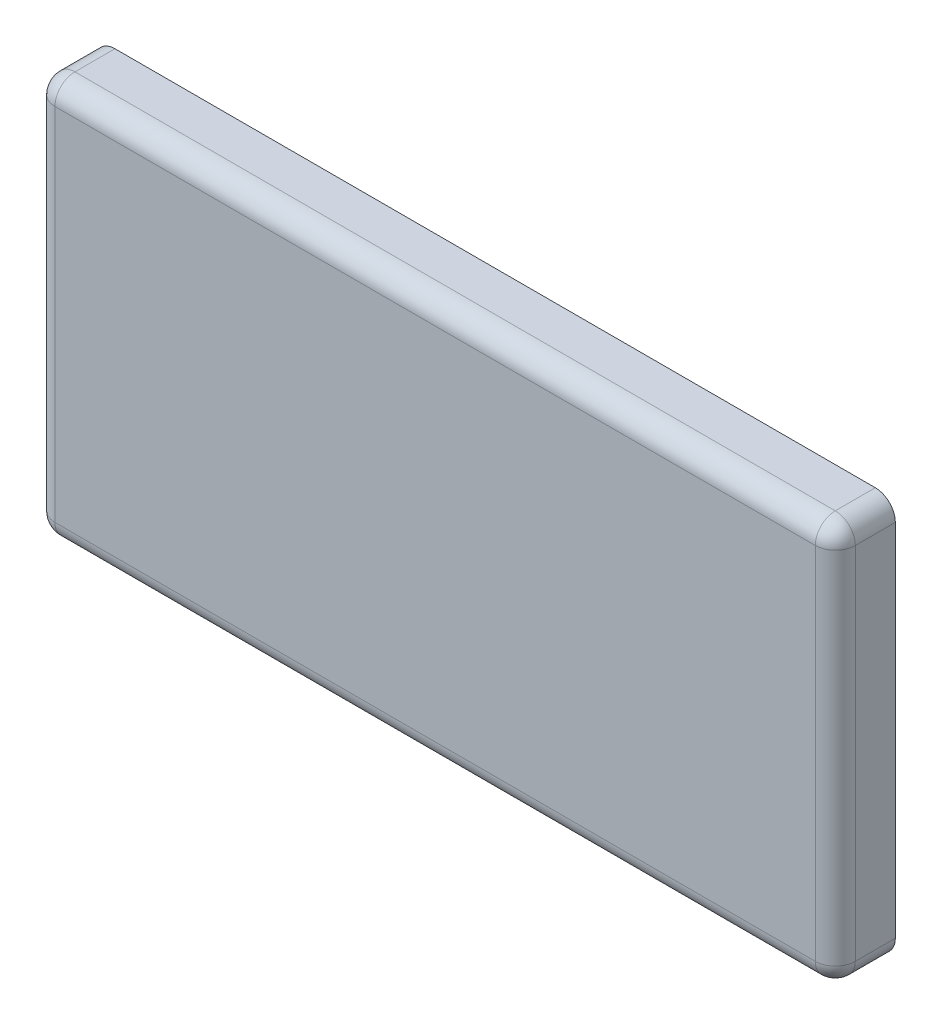
ISO-10303-21;
HEADER;
FILE_DESCRIPTION(('STEP AP214'),'2;1');
FILE_NAME('part.step','',(''),(''),'','','');
FILE_SCHEMA(('AUTOMOTIVE_DESIGN { 1 0 10303 214 1 1 1 1 }'));
ENDSEC;
DATA;
#1=APPLICATION_CONTEXT('core data for automotive mechanical design processes');
#2=APPLICATION_PROTOCOL_DEFINITION('international standard','automotive_design',2000,#1);
#3=PRODUCT_CONTEXT('',#1,'mechanical');
#4=PRODUCT('Part','Part','',(#3));
#5=PRODUCT_RELATED_PRODUCT_CATEGORY('part','',(#4));
#6=PRODUCT_DEFINITION_FORMATION('','',#4);
#7=PRODUCT_DEFINITION_CONTEXT('part definition',#1,'design');
#8=PRODUCT_DEFINITION('design','',#6,#7);
#9=PRODUCT_DEFINITION_SHAPE('','',#8);
#10=(LENGTH_UNIT() NAMED_UNIT(*) SI_UNIT(.MILLI.,.METRE.));
#11=(NAMED_UNIT(*) PLANE_ANGLE_UNIT() SI_UNIT($,.RADIAN.));
#12=(NAMED_UNIT(*) SI_UNIT($,.STERADIAN.) SOLID_ANGLE_UNIT());
#13=UNCERTAINTY_MEASURE_WITH_UNIT(LENGTH_MEASURE(1.E-05),#10,'distance_accuracy_value','');
#14=(GEOMETRIC_REPRESENTATION_CONTEXT(3) GLOBAL_UNCERTAINTY_ASSIGNED_CONTEXT((#13)) GLOBAL_UNIT_ASSIGNED_CONTEXT((#10,
#11,#12)) REPRESENTATION_CONTEXT('',''));
#15=CARTESIAN_POINT('',(0.,0.,0.));
#16=DIRECTION('',(0.,0.,1.));
#17=DIRECTION('',(1.,0.,0.));
#18=AXIS2_PLACEMENT_3D('',#15,#16,#17);
#19=CARTESIAN_POINT('',(-100.,-50.,15.));
#20=DIRECTION('',(1.,0.,0.));
#21=DIRECTION('',(0.,0.,-1.));
#22=AXIS2_PLACEMENT_3D('',#19,#20,#21);
#23=PLANE('',#22);
#24=DIRECTION('',(0.,-1.,0.));
#25=VECTOR('',#24,1.);
#26=CARTESIAN_POINT('',(-100.,50.,10.));
#27=LINE('',#26,#25);
#28=CARTESIAN_POINT('',(-100.,-45.,10.));
#29=VERTEX_POINT('',#28);
#30=CARTESIAN_POINT('',(-100.,45.,10.));
#31=VERTEX_POINT('',#30);
#32=EDGE_CURVE('E59',#29,#31,#27,.F.);
#33=ORIENTED_EDGE('',*,*,#32,.T.);
#34=DIRECTION('',(0.,0.,-1.));
#35=VECTOR('',#34,1.);
#36=CARTESIAN_POINT('',(-100.,45.,15.));
#37=LINE('',#36,#35);
#38=CARTESIAN_POINT('',(-100.,45.,0.));
#39=VERTEX_POINT('',#38);
#40=EDGE_CURVE('E179',#31,#39,#37,.T.);
#41=ORIENTED_EDGE('',*,*,#40,.T.);
#42=DIRECTION('',(0.,-1.,0.));
#43=VECTOR('',#42,1.);
#44=CARTESIAN_POINT('',(-100.,-50.,0.));
#45=LINE('',#44,#43);
#46=CARTESIAN_POINT('',(-100.,-45.,0.));
#47=VERTEX_POINT('',#46);
#48=EDGE_CURVE('E208',#39,#47,#45,.T.);
#49=ORIENTED_EDGE('',*,*,#48,.T.);
#50=DIRECTION('',(0.,0.,-1.));
#51=VECTOR('',#50,1.);
#52=CARTESIAN_POINT('',(-100.,-45.,15.));
#53=LINE('',#52,#51);
#54=EDGE_CURVE('E64',#47,#29,#53,.F.);
#55=ORIENTED_EDGE('',*,*,#54,.T.);
#56=EDGE_LOOP('',(#33,#41,#49,#55));
#57=FACE_BOUND('',#56,.T.);
#58=ADVANCED_FACE('F42',(#57),#23,.F.);
#59=CARTESIAN_POINT('',(100.,-50.,15.));
#60=DIRECTION('',(0.,1.,0.));
#61=DIRECTION('',(-1.,0.,0.));
#62=AXIS2_PLACEMENT_3D('',#59,#60,#61);
#63=PLANE('',#62);
#64=DIRECTION('',(1.,0.,0.));
#65=VECTOR('',#64,1.);
#66=CARTESIAN_POINT('',(100.,-50.,0.));
#67=LINE('',#66,#65);
#68=CARTESIAN_POINT('',(-95.,-50.,0.));
#69=VERTEX_POINT('',#68);
#70=CARTESIAN_POINT('',(95.,-50.,0.));
#71=VERTEX_POINT('',#70);
#72=EDGE_CURVE('E210',#69,#71,#67,.T.);
#73=ORIENTED_EDGE('',*,*,#72,.T.);
#74=DIRECTION('',(0.,0.,-1.));
#75=VECTOR('',#74,1.);
#76=CARTESIAN_POINT('',(95.,-50.,15.));
#77=LINE('',#76,#75);
#78=CARTESIAN_POINT('',(95.,-50.,10.));
#79=VERTEX_POINT('',#78);
#80=EDGE_CURVE('E175',#71,#79,#77,.F.);
#81=ORIENTED_EDGE('',*,*,#80,.T.);
#82=DIRECTION('',(1.,0.,0.));
#83=VECTOR('',#82,1.);
#84=CARTESIAN_POINT('',(-100.,-50.,10.));
#85=LINE('',#84,#83);
#86=CARTESIAN_POINT('',(-95.,-50.,10.));
#87=VERTEX_POINT('',#86);
#88=EDGE_CURVE('E173',#79,#87,#85,.F.);
#89=ORIENTED_EDGE('',*,*,#88,.T.);
#90=DIRECTION('',(0.,0.,-1.));
#91=VECTOR('',#90,1.);
#92=CARTESIAN_POINT('',(-95.,-50.,15.));
#93=LINE('',#92,#91);
#94=EDGE_CURVE('E171',#87,#69,#93,.T.);
#95=ORIENTED_EDGE('',*,*,#94,.T.);
#96=EDGE_LOOP('',(#73,#81,#89,#95));
#97=FACE_BOUND('',#96,.T.);
#98=ADVANCED_FACE('F262',(#97),#63,.F.);
#99=CARTESIAN_POINT('',(100.,-50.,15.));
#100=DIRECTION('',(-1.,0.,0.));
#101=DIRECTION('',(0.,0.,1.));
#102=AXIS2_PLACEMENT_3D('',#99,#100,#101);
#103=PLANE('',#102);
#104=DIRECTION('',(0.,1.,0.));
#105=VECTOR('',#104,1.);
#106=CARTESIAN_POINT('',(100.,-50.,0.));
#107=LINE('',#106,#105);
#108=CARTESIAN_POINT('',(100.,-45.,0.));
#109=VERTEX_POINT('',#108);
#110=CARTESIAN_POINT('',(100.,45.,0.));
#111=VERTEX_POINT('',#110);
#112=EDGE_CURVE('E214',#109,#111,#107,.T.);
#113=ORIENTED_EDGE('',*,*,#112,.T.);
#114=DIRECTION('',(0.,0.,-1.));
#115=VECTOR('',#114,1.);
#116=CARTESIAN_POINT('',(100.,45.,15.));
#117=LINE('',#116,#115);
#118=CARTESIAN_POINT('',(100.,45.,10.));
#119=VERTEX_POINT('',#118);
#120=EDGE_CURVE('E169',#111,#119,#117,.F.);
#121=ORIENTED_EDGE('',*,*,#120,.T.);
#122=DIRECTION('',(0.,1.,0.));
#123=VECTOR('',#122,1.);
#124=CARTESIAN_POINT('',(100.,-50.,10.));
#125=LINE('',#124,#123);
#126=CARTESIAN_POINT('',(100.,-45.,10.));
#127=VERTEX_POINT('',#126);
#128=EDGE_CURVE('E167',#119,#127,#125,.F.);
#129=ORIENTED_EDGE('',*,*,#128,.T.);
#130=DIRECTION('',(0.,0.,-1.));
#131=VECTOR('',#130,1.);
#132=CARTESIAN_POINT('',(100.,-45.,15.));
#133=LINE('',#132,#131);
#134=EDGE_CURVE('E165',#127,#109,#133,.T.);
#135=ORIENTED_EDGE('',*,*,#134,.T.);
#136=EDGE_LOOP('',(#113,#121,#129,#135));
#137=FACE_BOUND('',#136,.T.);
#138=ADVANCED_FACE('F267',(#137),#103,.F.);
#139=CARTESIAN_POINT('',(100.,50.,15.));
#140=DIRECTION('',(0.,-1.,0.));
#141=DIRECTION('',(0.,0.,-1.));
#142=AXIS2_PLACEMENT_3D('',#139,#140,#141);
#143=PLANE('',#142);
#144=DIRECTION('',(-1.,0.,0.));
#145=VECTOR('',#144,1.);
#146=CARTESIAN_POINT('',(100.,50.,0.));
#147=LINE('',#146,#145);
#148=CARTESIAN_POINT('',(95.,50.,0.));
#149=VERTEX_POINT('',#148);
#150=CARTESIAN_POINT('',(-95.,50.,0.));
#151=VERTEX_POINT('',#150);
#152=EDGE_CURVE('E149',#149,#151,#147,.T.);
#153=ORIENTED_EDGE('',*,*,#152,.T.);
#154=DIRECTION('',(0.,0.,-1.));
#155=VECTOR('',#154,1.);
#156=CARTESIAN_POINT('',(-95.,50.,15.));
#157=LINE('',#156,#155);
#158=CARTESIAN_POINT('',(-95.,50.,10.));
#159=VERTEX_POINT('',#158);
#160=EDGE_CURVE('E163',#151,#159,#157,.F.);
#161=ORIENTED_EDGE('',*,*,#160,.T.);
#162=DIRECTION('',(-1.,0.,0.));
#163=VECTOR('',#162,1.);
#164=CARTESIAN_POINT('',(100.,50.,10.));
#165=LINE('',#164,#163);
#166=CARTESIAN_POINT('',(95.,50.,10.));
#167=VERTEX_POINT('',#166);
#168=EDGE_CURVE('E127',#159,#167,#165,.F.);
#169=ORIENTED_EDGE('',*,*,#168,.T.);
#170=DIRECTION('',(0.,0.,-1.));
#171=VECTOR('',#170,1.);
#172=CARTESIAN_POINT('',(95.,50.,15.));
#173=LINE('',#172,#171);
#174=EDGE_CURVE('E156',#167,#149,#173,.T.);
#175=ORIENTED_EDGE('',*,*,#174,.T.);
#176=EDGE_LOOP('',(#153,#161,#169,#175));
#177=FACE_BOUND('',#176,.T.);
#178=ADVANCED_FACE('F239',(#177),#143,.F.);
#179=CARTESIAN_POINT('',(0.,0.,15.));
#180=DIRECTION('',(0.,0.,1.));
#181=DIRECTION('',(1.,0.,0.));
#182=AXIS2_PLACEMENT_3D('',#179,#180,#181);
#183=PLANE('',#182);
#184=DIRECTION('',(0.,1.,0.));
#185=VECTOR('',#184,1.);
#186=CARTESIAN_POINT('',(95.,50.,15.));
#187=LINE('',#186,#185);
#188=CARTESIAN_POINT('',(95.,-45.,15.));
#189=VERTEX_POINT('',#188);
#190=CARTESIAN_POINT('',(95.,45.,15.));
#191=VERTEX_POINT('',#190);
#192=EDGE_CURVE('E154',#189,#191,#187,.T.);
#193=ORIENTED_EDGE('',*,*,#192,.T.);
#194=DIRECTION('',(-1.,0.,0.));
#195=VECTOR('',#194,1.);
#196=CARTESIAN_POINT('',(-100.,45.,15.));
#197=LINE('',#196,#195);
#198=CARTESIAN_POINT('',(-95.,45.,15.));
#199=VERTEX_POINT('',#198);
#200=EDGE_CURVE('E125',#191,#199,#197,.T.);
#201=ORIENTED_EDGE('',*,*,#200,.T.);
#202=DIRECTION('',(0.,-1.,0.));
#203=VECTOR('',#202,1.);
#204=CARTESIAN_POINT('',(-95.,-50.,15.));
#205=LINE('',#204,#203);
#206=CARTESIAN_POINT('',(-95.,-45.,15.));
#207=VERTEX_POINT('',#206);
#208=EDGE_CURVE('E142',#199,#207,#205,.T.);
#209=ORIENTED_EDGE('',*,*,#208,.T.);
#210=DIRECTION('',(1.,0.,0.));
#211=VECTOR('',#210,1.);
#212=CARTESIAN_POINT('',(100.,-45.,15.));
#213=LINE('',#212,#211);
#214=EDGE_CURVE('E148',#207,#189,#213,.T.);
#215=ORIENTED_EDGE('',*,*,#214,.T.);
#216=EDGE_LOOP('',(#193,#201,#209,#215));
#217=FACE_BOUND('',#216,.T.);
#218=ADVANCED_FACE('F152',(#217),#183,.T.);
#219=CARTESIAN_POINT('',(0.,0.,0.));
#220=DIRECTION('',(0.,0.,1.));
#221=DIRECTION('',(1.,0.,0.));
#222=AXIS2_PLACEMENT_3D('',#219,#220,#221);
#223=PLANE('',#222);
#224=ORIENTED_EDGE('',*,*,#48,.F.);
#225=CARTESIAN_POINT('',(-95.,45.,0.));
#226=DIRECTION('',(0.,0.,1.));
#227=DIRECTION('',(1.,0.,0.));
#228=AXIS2_PLACEMENT_3D('',#225,#226,#227);
#229=CIRCLE('',#228,5.);
#230=EDGE_CURVE('E11',#39,#151,#229,.F.);
#231=ORIENTED_EDGE('',*,*,#230,.T.);
#232=ORIENTED_EDGE('',*,*,#152,.F.);
#233=CARTESIAN_POINT('',(95.,45.,0.));
#234=DIRECTION('',(0.,0.,1.));
#235=DIRECTION('',(1.,0.,0.));
#236=AXIS2_PLACEMENT_3D('',#233,#234,#235);
#237=CIRCLE('',#236,5.);
#238=EDGE_CURVE('E51',#149,#111,#237,.F.);
#239=ORIENTED_EDGE('',*,*,#238,.T.);
#240=ORIENTED_EDGE('',*,*,#112,.F.);
#241=CARTESIAN_POINT('',(95.,-45.,0.));
#242=DIRECTION('',(0.,0.,1.));
#243=DIRECTION('',(1.,0.,0.));
#244=AXIS2_PLACEMENT_3D('',#241,#242,#243);
#245=CIRCLE('',#244,5.);
#246=EDGE_CURVE('E183',#109,#71,#245,.F.);
#247=ORIENTED_EDGE('',*,*,#246,.T.);
#248=ORIENTED_EDGE('',*,*,#72,.F.);
#249=CARTESIAN_POINT('',(-95.,-45.,0.));
#250=DIRECTION('',(0.,0.,1.));
#251=DIRECTION('',(1.,0.,0.));
#252=AXIS2_PLACEMENT_3D('',#249,#250,#251);
#253=CIRCLE('',#252,5.);
#254=EDGE_CURVE('E181',#69,#47,#253,.F.);
#255=ORIENTED_EDGE('',*,*,#254,.T.);
#256=EDGE_LOOP('',(#224,#231,#232,#239,#240,#247,#248,#255));
#257=FACE_BOUND('',#256,.T.);
#258=ADVANCED_FACE('F245',(#257),#223,.F.);
#259=CARTESIAN_POINT('',(95.,-45.,15.));
#260=DIRECTION('',(0.,0.,-1.));
#261=DIRECTION('',(-1.,0.,0.));
#262=AXIS2_PLACEMENT_3D('',#259,#260,#261);
#263=CYLINDRICAL_SURFACE('',#262,5.);
#264=ORIENTED_EDGE('',*,*,#246,.F.);
#265=ORIENTED_EDGE('',*,*,#134,.F.);
#266=CARTESIAN_POINT('',(95.,-45.,10.));
#267=DIRECTION('',(0.,0.,1.));
#268=DIRECTION('',(1.,0.,0.));
#269=AXIS2_PLACEMENT_3D('',#266,#267,#268);
#270=CIRCLE('',#269,5.);
#271=EDGE_CURVE('E46',#79,#127,#270,.T.);
#272=ORIENTED_EDGE('',*,*,#271,.F.);
#273=ORIENTED_EDGE('',*,*,#80,.F.);
#274=EDGE_LOOP('',(#264,#265,#272,#273));
#275=FACE_BOUND('',#274,.T.);
#276=ADVANCED_FACE('F44',(#275),#263,.T.);
#277=CARTESIAN_POINT('',(0.,-45.,10.));
#278=DIRECTION('',(-1.,0.,0.));
#279=DIRECTION('',(0.,-1.,0.));
#280=AXIS2_PLACEMENT_3D('',#277,#278,#279);
#281=CYLINDRICAL_SURFACE('',#280,5.);
#282=CARTESIAN_POINT('',(-95.,-45.,10.));
#283=DIRECTION('',(-1.,0.,0.));
#284=DIRECTION('',(0.,0.,1.));
#285=AXIS2_PLACEMENT_3D('',#282,#283,#284);
#286=CIRCLE('',#285,5.);
#287=EDGE_CURVE('E200',#87,#207,#286,.T.);
#288=ORIENTED_EDGE('',*,*,#287,.F.);
#289=ORIENTED_EDGE('',*,*,#88,.F.);
#290=CARTESIAN_POINT('',(95.,-45.,10.));
#291=DIRECTION('',(1.,0.,0.));
#292=DIRECTION('',(0.,0.,-1.));
#293=AXIS2_PLACEMENT_3D('',#290,#291,#292);
#294=CIRCLE('',#293,5.);
#295=EDGE_CURVE('E202',#189,#79,#294,.T.);
#296=ORIENTED_EDGE('',*,*,#295,.F.);
#297=ORIENTED_EDGE('',*,*,#214,.F.);
#298=EDGE_LOOP('',(#288,#289,#296,#297));
#299=FACE_BOUND('',#298,.T.);
#300=ADVANCED_FACE('F223',(#299),#281,.T.);
#301=CARTESIAN_POINT('',(-95.,-45.,15.));
#302=DIRECTION('',(0.,0.,-1.));
#303=DIRECTION('',(-1.,0.,0.));
#304=AXIS2_PLACEMENT_3D('',#301,#302,#303);
#305=CYLINDRICAL_SURFACE('',#304,5.);
#306=ORIENTED_EDGE('',*,*,#254,.F.);
#307=ORIENTED_EDGE('',*,*,#94,.F.);
#308=CARTESIAN_POINT('',(-95.,-45.,10.));
#309=DIRECTION('',(0.,0.,1.));
#310=DIRECTION('',(1.,0.,0.));
#311=AXIS2_PLACEMENT_3D('',#308,#309,#310);
#312=CIRCLE('',#311,5.);
#313=EDGE_CURVE('E197',#29,#87,#312,.T.);
#314=ORIENTED_EDGE('',*,*,#313,.F.);
#315=ORIENTED_EDGE('',*,*,#54,.F.);
#316=EDGE_LOOP('',(#306,#307,#314,#315));
#317=FACE_BOUND('',#316,.T.);
#318=ADVANCED_FACE('F250',(#317),#305,.T.);
#319=CARTESIAN_POINT('',(95.,-45.,10.));
#320=DIRECTION('',(0.,-1.,0.));
#321=DIRECTION('',(0.,0.,-1.));
#322=AXIS2_PLACEMENT_3D('',#319,#320,#321);
#323=SPHERICAL_SURFACE('',#322,5.);
#324=ORIENTED_EDGE('',*,*,#295,.T.);
#325=ORIENTED_EDGE('',*,*,#271,.T.);
#326=CARTESIAN_POINT('',(95.,-45.,10.));
#327=DIRECTION('',(0.,-1.,0.));
#328=DIRECTION('',(0.,0.,-1.));
#329=AXIS2_PLACEMENT_3D('',#326,#327,#328);
#330=CIRCLE('',#329,5.);
#331=EDGE_CURVE('E194',#189,#127,#330,.F.);
#332=ORIENTED_EDGE('',*,*,#331,.F.);
#333=EDGE_LOOP('',(#324,#325,#332));
#334=FACE_BOUND('',#333,.T.);
#335=ADVANCED_FACE('F224',(#334),#323,.T.);
#336=CARTESIAN_POINT('',(-95.,-45.,10.));
#337=DIRECTION('',(0.,-1.,0.));
#338=DIRECTION('',(0.,0.,-1.));
#339=AXIS2_PLACEMENT_3D('',#336,#337,#338);
#340=SPHERICAL_SURFACE('',#339,5.);
#341=ORIENTED_EDGE('',*,*,#313,.T.);
#342=ORIENTED_EDGE('',*,*,#287,.T.);
#343=CARTESIAN_POINT('',(-95.,-45.,10.));
#344=DIRECTION('',(0.,-1.,0.));
#345=DIRECTION('',(0.,0.,-1.));
#346=AXIS2_PLACEMENT_3D('',#343,#344,#345);
#347=CIRCLE('',#346,5.);
#348=EDGE_CURVE('E145',#29,#207,#347,.F.);
#349=ORIENTED_EDGE('',*,*,#348,.F.);
#350=EDGE_LOOP('',(#341,#342,#349));
#351=FACE_BOUND('',#350,.T.);
#352=ADVANCED_FACE('F252',(#351),#340,.T.);
#353=CARTESIAN_POINT('',(95.,45.,15.));
#354=DIRECTION('',(0.,0.,-1.));
#355=DIRECTION('',(-1.,0.,0.));
#356=AXIS2_PLACEMENT_3D('',#353,#354,#355);
#357=CYLINDRICAL_SURFACE('',#356,5.);
#358=ORIENTED_EDGE('',*,*,#238,.F.);
#359=ORIENTED_EDGE('',*,*,#174,.F.);
#360=CARTESIAN_POINT('',(95.,45.,10.));
#361=DIRECTION('',(0.,0.,1.));
#362=DIRECTION('',(1.,0.,0.));
#363=AXIS2_PLACEMENT_3D('',#360,#361,#362);
#364=CIRCLE('',#363,5.);
#365=EDGE_CURVE('E190',#119,#167,#364,.T.);
#366=ORIENTED_EDGE('',*,*,#365,.F.);
#367=ORIENTED_EDGE('',*,*,#120,.F.);
#368=EDGE_LOOP('',(#358,#359,#366,#367));
#369=FACE_BOUND('',#368,.T.);
#370=ADVANCED_FACE('F236',(#369),#357,.T.);
#371=CARTESIAN_POINT('',(95.,0.,10.));
#372=DIRECTION('',(0.,-1.,0.));
#373=DIRECTION('',(0.,0.,-1.));
#374=AXIS2_PLACEMENT_3D('',#371,#372,#373);
#375=CYLINDRICAL_SURFACE('',#374,5.);
#376=ORIENTED_EDGE('',*,*,#331,.T.);
#377=ORIENTED_EDGE('',*,*,#128,.F.);
#378=CARTESIAN_POINT('',(95.,45.,10.));
#379=DIRECTION('',(0.,1.,0.));
#380=DIRECTION('',(0.,0.,1.));
#381=AXIS2_PLACEMENT_3D('',#378,#379,#380);
#382=CIRCLE('',#381,5.);
#383=EDGE_CURVE('E139',#191,#119,#382,.T.);
#384=ORIENTED_EDGE('',*,*,#383,.F.);
#385=ORIENTED_EDGE('',*,*,#192,.F.);
#386=EDGE_LOOP('',(#376,#377,#384,#385));
#387=FACE_BOUND('',#386,.T.);
#388=ADVANCED_FACE('F227',(#387),#375,.T.);
#389=CARTESIAN_POINT('',(-95.,0.,10.));
#390=DIRECTION('',(0.,1.,0.));
#391=DIRECTION('',(0.,0.,1.));
#392=AXIS2_PLACEMENT_3D('',#389,#390,#391);
#393=CYLINDRICAL_SURFACE('',#392,5.);
#394=ORIENTED_EDGE('',*,*,#348,.T.);
#395=ORIENTED_EDGE('',*,*,#208,.F.);
#396=CARTESIAN_POINT('',(-95.,45.,10.));
#397=DIRECTION('',(0.,1.,0.));
#398=DIRECTION('',(0.,0.,1.));
#399=AXIS2_PLACEMENT_3D('',#396,#397,#398);
#400=CIRCLE('',#399,5.);
#401=EDGE_CURVE('E133',#31,#199,#400,.T.);
#402=ORIENTED_EDGE('',*,*,#401,.F.);
#403=ORIENTED_EDGE('',*,*,#32,.F.);
#404=EDGE_LOOP('',(#394,#395,#402,#403));
#405=FACE_BOUND('',#404,.T.);
#406=ADVANCED_FACE('F143',(#405),#393,.T.);
#407=CARTESIAN_POINT('',(-95.,45.,15.));
#408=DIRECTION('',(0.,0.,-1.));
#409=DIRECTION('',(-1.,0.,0.));
#410=AXIS2_PLACEMENT_3D('',#407,#408,#409);
#411=CYLINDRICAL_SURFACE('',#410,5.);
#412=ORIENTED_EDGE('',*,*,#230,.F.);
#413=ORIENTED_EDGE('',*,*,#40,.F.);
#414=CARTESIAN_POINT('',(-95.,45.,10.));
#415=DIRECTION('',(0.,0.,1.));
#416=DIRECTION('',(1.,0.,0.));
#417=AXIS2_PLACEMENT_3D('',#414,#415,#416);
#418=CIRCLE('',#417,5.);
#419=EDGE_CURVE('E137',#159,#31,#418,.T.);
#420=ORIENTED_EDGE('',*,*,#419,.F.);
#421=ORIENTED_EDGE('',*,*,#160,.F.);
#422=EDGE_LOOP('',(#412,#413,#420,#421));
#423=FACE_BOUND('',#422,.T.);
#424=ADVANCED_FACE('F243',(#423),#411,.T.);
#425=CARTESIAN_POINT('',(95.,45.,10.));
#426=DIRECTION('',(1.,0.,0.));
#427=DIRECTION('',(0.,0.,-1.));
#428=AXIS2_PLACEMENT_3D('',#425,#426,#427);
#429=SPHERICAL_SURFACE('',#428,5.);
#430=ORIENTED_EDGE('',*,*,#383,.T.);
#431=ORIENTED_EDGE('',*,*,#365,.T.);
#432=CARTESIAN_POINT('',(95.,45.,10.));
#433=DIRECTION('',(1.,0.,0.));
#434=DIRECTION('',(0.,0.,-1.));
#435=AXIS2_PLACEMENT_3D('',#432,#433,#434);
#436=CIRCLE('',#435,5.);
#437=EDGE_CURVE('E130',#191,#167,#436,.F.);
#438=ORIENTED_EDGE('',*,*,#437,.F.);
#439=EDGE_LOOP('',(#430,#431,#438));
#440=FACE_BOUND('',#439,.T.);
#441=ADVANCED_FACE('F231',(#440),#429,.T.);
#442=CARTESIAN_POINT('',(-95.,45.,10.));
#443=DIRECTION('',(-1.,0.,0.));
#444=DIRECTION('',(0.,-1.,0.));
#445=AXIS2_PLACEMENT_3D('',#442,#443,#444);
#446=SPHERICAL_SURFACE('',#445,5.);
#447=ORIENTED_EDGE('',*,*,#419,.T.);
#448=ORIENTED_EDGE('',*,*,#401,.T.);
#449=CARTESIAN_POINT('',(-95.,45.,10.));
#450=DIRECTION('',(-1.,0.,0.));
#451=DIRECTION('',(0.,0.,1.));
#452=AXIS2_PLACEMENT_3D('',#449,#450,#451);
#453=CIRCLE('',#452,5.);
#454=EDGE_CURVE('E121',#159,#199,#453,.F.);
#455=ORIENTED_EDGE('',*,*,#454,.F.);
#456=EDGE_LOOP('',(#447,#448,#455));
#457=FACE_BOUND('',#456,.T.);
#458=ADVANCED_FACE('F135',(#457),#446,.T.);
#459=CARTESIAN_POINT('',(0.,45.,10.));
#460=DIRECTION('',(1.,0.,0.));
#461=DIRECTION('',(0.,0.,-1.));
#462=AXIS2_PLACEMENT_3D('',#459,#460,#461);
#463=CYLINDRICAL_SURFACE('',#462,5.);
#464=ORIENTED_EDGE('',*,*,#437,.T.);
#465=ORIENTED_EDGE('',*,*,#168,.F.);
#466=ORIENTED_EDGE('',*,*,#454,.T.);
#467=ORIENTED_EDGE('',*,*,#200,.F.);
#468=EDGE_LOOP('',(#464,#465,#466,#467));
#469=FACE_BOUND('',#468,.T.);
#470=ADVANCED_FACE('F123',(#469),#463,.T.);
#471=CLOSED_SHELL('',(#58,#98,#138,#178,#218,#258,#276,#300,#318,#335,#352,#370,#388,#406,#424,
#441,#458,#470));
#472=MANIFOLD_SOLID_BREP('B2',#471);
#473=ADVANCED_BREP_SHAPE_REPRESENTATION('',(#18,#472),#14);
#474=SHAPE_DEFINITION_REPRESENTATION(#9,#473);
ENDSEC;
END-ISO-10303-21;
